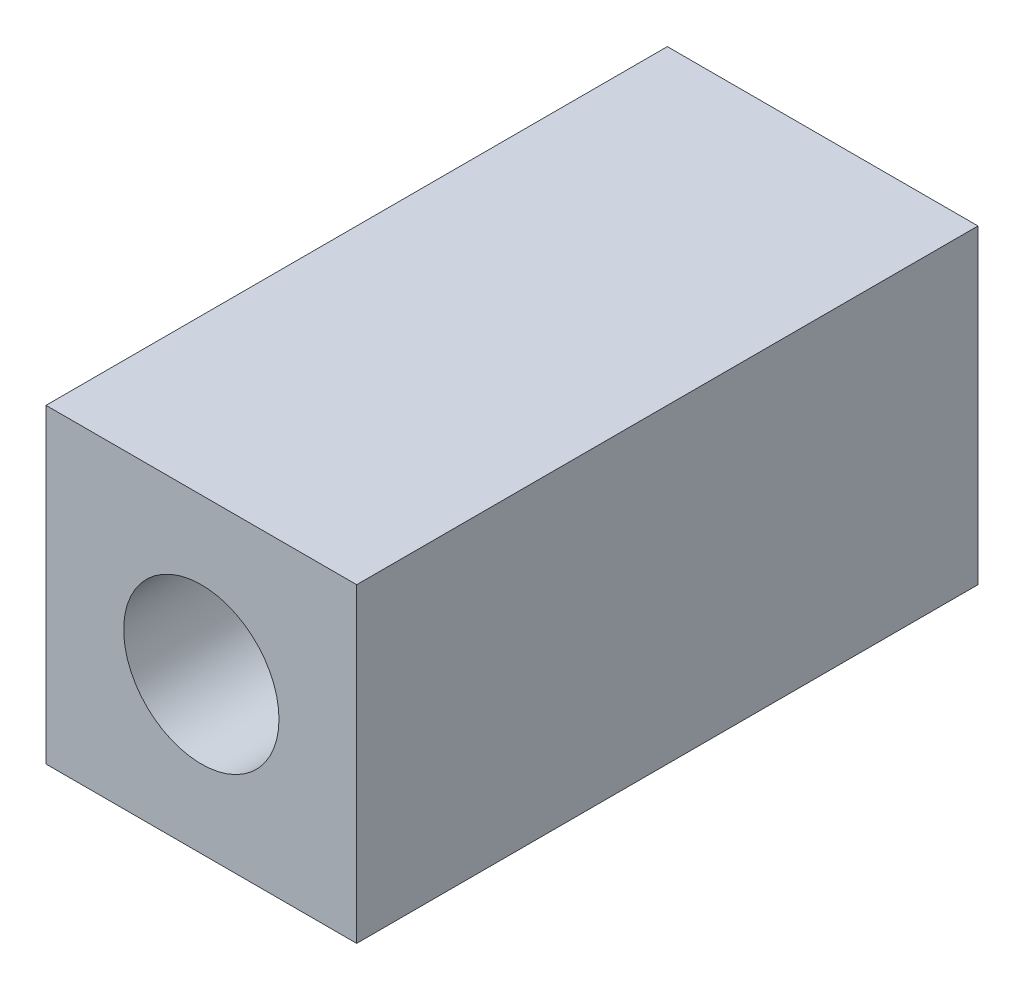
ISO-10303-21;
HEADER;
FILE_DESCRIPTION(('STEP AP214'),'2;1');
FILE_NAME('part.step','',(''),(''),'','','');
FILE_SCHEMA(('AUTOMOTIVE_DESIGN { 1 0 10303 214 1 1 1 1 }'));
ENDSEC;
DATA;
#1=APPLICATION_CONTEXT('core data for automotive mechanical design processes');
#2=APPLICATION_PROTOCOL_DEFINITION('international standard','automotive_design',2000,#1);
#3=PRODUCT_CONTEXT('',#1,'mechanical');
#4=PRODUCT('Part','Part','',(#3));
#5=PRODUCT_RELATED_PRODUCT_CATEGORY('part','',(#4));
#6=PRODUCT_DEFINITION_FORMATION('','',#4);
#7=PRODUCT_DEFINITION_CONTEXT('part definition',#1,'design');
#8=PRODUCT_DEFINITION('design','',#6,#7);
#9=PRODUCT_DEFINITION_SHAPE('','',#8);
#10=(LENGTH_UNIT() NAMED_UNIT(*) SI_UNIT(.MILLI.,.METRE.));
#11=(NAMED_UNIT(*) PLANE_ANGLE_UNIT() SI_UNIT($,.RADIAN.));
#12=(NAMED_UNIT(*) SI_UNIT($,.STERADIAN.) SOLID_ANGLE_UNIT());
#13=UNCERTAINTY_MEASURE_WITH_UNIT(LENGTH_MEASURE(1.E-05),#10,'distance_accuracy_value','');
#14=(GEOMETRIC_REPRESENTATION_CONTEXT(3) GLOBAL_UNCERTAINTY_ASSIGNED_CONTEXT((#13)) GLOBAL_UNIT_ASSIGNED_CONTEXT((#10,
#11,#12)) REPRESENTATION_CONTEXT('',''));
#15=CARTESIAN_POINT('',(0.,0.,0.));
#16=DIRECTION('',(0.,0.,1.));
#17=DIRECTION('',(1.,0.,0.));
#18=AXIS2_PLACEMENT_3D('',#15,#16,#17);
#19=CARTESIAN_POINT('',(0.,0.,20.));
#20=DIRECTION('',(0.,0.,1.));
#21=DIRECTION('',(1.,0.,0.));
#22=AXIS2_PLACEMENT_3D('',#19,#20,#21);
#23=PLANE('',#22);
#24=DIRECTION('',(0.,-1.,0.));
#25=VECTOR('',#24,1.);
#26=CARTESIAN_POINT('',(0.,0.,20.));
#27=LINE('',#26,#25);
#28=CARTESIAN_POINT('',(0.,0.,20.));
#29=VERTEX_POINT('',#28);
#30=CARTESIAN_POINT('',(0.,-10.,20.));
#31=VERTEX_POINT('',#30);
#32=EDGE_CURVE('E85',#29,#31,#27,.T.);
#33=ORIENTED_EDGE('',*,*,#32,.T.);
#34=DIRECTION('',(1.,0.,0.));
#35=VECTOR('',#34,1.);
#36=CARTESIAN_POINT('',(0.,-10.,20.));
#37=LINE('',#36,#35);
#38=CARTESIAN_POINT('',(10.,-10.,20.));
#39=VERTEX_POINT('',#38);
#40=EDGE_CURVE('E80',#31,#39,#37,.T.);
#41=ORIENTED_EDGE('',*,*,#40,.T.);
#42=DIRECTION('',(0.,1.,0.));
#43=VECTOR('',#42,1.);
#44=CARTESIAN_POINT('',(10.,0.,20.));
#45=LINE('',#44,#43);
#46=CARTESIAN_POINT('',(10.,0.,20.));
#47=VERTEX_POINT('',#46);
#48=EDGE_CURVE('E83',#39,#47,#45,.T.);
#49=ORIENTED_EDGE('',*,*,#48,.T.);
#50=DIRECTION('',(-1.,0.,0.));
#51=VECTOR('',#50,1.);
#52=CARTESIAN_POINT('',(0.,0.,20.));
#53=LINE('',#52,#51);
#54=EDGE_CURVE('E50',#47,#29,#53,.T.);
#55=ORIENTED_EDGE('',*,*,#54,.T.);
#56=EDGE_LOOP('',(#33,#41,#49,#55));
#57=FACE_BOUND('',#56,.T.);
#58=CARTESIAN_POINT('',(5.,-5.,20.));
#59=DIRECTION('',(0.,0.,1.));
#60=DIRECTION('',(1.,0.,0.));
#61=AXIS2_PLACEMENT_3D('',#58,#59,#60);
#62=CIRCLE('',#61,2.5);
#63=CARTESIAN_POINT('',(7.5,-5.,20.));
#64=VERTEX_POINT('',#63);
#65=EDGE_CURVE('E100',#64,#64,#62,.T.);
#66=ORIENTED_EDGE('',*,*,#65,.F.);
#67=EDGE_LOOP('',(#66));
#68=FACE_BOUND('',#67,.T.);
#69=ADVANCED_FACE('F33',(#57,#68),#23,.T.);
#70=CARTESIAN_POINT('',(0.,0.,0.));
#71=DIRECTION('',(0.,0.,1.));
#72=DIRECTION('',(1.,0.,0.));
#73=AXIS2_PLACEMENT_3D('',#70,#71,#72);
#74=PLANE('',#73);
#75=DIRECTION('',(0.,-1.,0.));
#76=VECTOR('',#75,1.);
#77=CARTESIAN_POINT('',(0.,0.,0.));
#78=LINE('',#77,#76);
#79=CARTESIAN_POINT('',(0.,0.,0.));
#80=VERTEX_POINT('',#79);
#81=CARTESIAN_POINT('',(0.,-10.,0.));
#82=VERTEX_POINT('',#81);
#83=EDGE_CURVE('E97',#80,#82,#78,.T.);
#84=ORIENTED_EDGE('',*,*,#83,.F.);
#85=DIRECTION('',(-1.,0.,0.));
#86=VECTOR('',#85,1.);
#87=CARTESIAN_POINT('',(0.,0.,0.));
#88=LINE('',#87,#86);
#89=CARTESIAN_POINT('',(10.,0.,0.));
#90=VERTEX_POINT('',#89);
#91=EDGE_CURVE('E73',#90,#80,#88,.T.);
#92=ORIENTED_EDGE('',*,*,#91,.F.);
#93=DIRECTION('',(0.,1.,0.));
#94=VECTOR('',#93,1.);
#95=CARTESIAN_POINT('',(10.,0.,0.));
#96=LINE('',#95,#94);
#97=CARTESIAN_POINT('',(10.,-10.,0.));
#98=VERTEX_POINT('',#97);
#99=EDGE_CURVE('E67',#98,#90,#96,.T.);
#100=ORIENTED_EDGE('',*,*,#99,.F.);
#101=DIRECTION('',(1.,0.,0.));
#102=VECTOR('',#101,1.);
#103=CARTESIAN_POINT('',(0.,-10.,0.));
#104=LINE('',#103,#102);
#105=EDGE_CURVE('E89',#82,#98,#104,.T.);
#106=ORIENTED_EDGE('',*,*,#105,.F.);
#107=EDGE_LOOP('',(#84,#92,#100,#106));
#108=FACE_BOUND('',#107,.T.);
#109=CARTESIAN_POINT('',(5.,-5.,0.));
#110=DIRECTION('',(0.,0.,1.));
#111=DIRECTION('',(1.,0.,0.));
#112=AXIS2_PLACEMENT_3D('',#109,#110,#111);
#113=CIRCLE('',#112,2.5);
#114=CARTESIAN_POINT('',(7.5,-5.,0.));
#115=VERTEX_POINT('',#114);
#116=EDGE_CURVE('E112',#115,#115,#113,.T.);
#117=ORIENTED_EDGE('',*,*,#116,.T.);
#118=EDGE_LOOP('',(#117));
#119=FACE_BOUND('',#118,.T.);
#120=ADVANCED_FACE('F108',(#108,#119),#74,.F.);
#121=CARTESIAN_POINT('',(0.,0.,20.));
#122=DIRECTION('',(1.,0.,0.));
#123=DIRECTION('',(0.,0.,-1.));
#124=AXIS2_PLACEMENT_3D('',#121,#122,#123);
#125=PLANE('',#124);
#126=ORIENTED_EDGE('',*,*,#83,.T.);
#127=DIRECTION('',(0.,0.,-1.));
#128=VECTOR('',#127,1.);
#129=CARTESIAN_POINT('',(0.,-10.,20.));
#130=LINE('',#129,#128);
#131=EDGE_CURVE('E11',#31,#82,#130,.T.);
#132=ORIENTED_EDGE('',*,*,#131,.F.);
#133=ORIENTED_EDGE('',*,*,#32,.F.);
#134=DIRECTION('',(0.,0.,-1.));
#135=VECTOR('',#134,1.);
#136=CARTESIAN_POINT('',(0.,0.,20.));
#137=LINE('',#136,#135);
#138=EDGE_CURVE('E93',#29,#80,#137,.T.);
#139=ORIENTED_EDGE('',*,*,#138,.T.);
#140=EDGE_LOOP('',(#126,#132,#133,#139));
#141=FACE_BOUND('',#140,.T.);
#142=ADVANCED_FACE('F35',(#141),#125,.F.);
#143=CARTESIAN_POINT('',(0.,-10.,20.));
#144=DIRECTION('',(0.,1.,0.));
#145=DIRECTION('',(-1.,0.,0.));
#146=AXIS2_PLACEMENT_3D('',#143,#144,#145);
#147=PLANE('',#146);
#148=ORIENTED_EDGE('',*,*,#105,.T.);
#149=DIRECTION('',(0.,0.,-1.));
#150=VECTOR('',#149,1.);
#151=CARTESIAN_POINT('',(10.,-10.,20.));
#152=LINE('',#151,#150);
#153=EDGE_CURVE('E42',#39,#98,#152,.T.);
#154=ORIENTED_EDGE('',*,*,#153,.F.);
#155=ORIENTED_EDGE('',*,*,#40,.F.);
#156=ORIENTED_EDGE('',*,*,#131,.T.);
#157=EDGE_LOOP('',(#148,#154,#155,#156));
#158=FACE_BOUND('',#157,.T.);
#159=ADVANCED_FACE('F88',(#158),#147,.F.);
#160=CARTESIAN_POINT('',(10.,0.,20.));
#161=DIRECTION('',(-1.,0.,0.));
#162=DIRECTION('',(0.,-1.,0.));
#163=AXIS2_PLACEMENT_3D('',#160,#161,#162);
#164=PLANE('',#163);
#165=ORIENTED_EDGE('',*,*,#99,.T.);
#166=DIRECTION('',(0.,0.,-1.));
#167=VECTOR('',#166,1.);
#168=CARTESIAN_POINT('',(10.,0.,20.));
#169=LINE('',#168,#167);
#170=EDGE_CURVE('E90',#47,#90,#169,.T.);
#171=ORIENTED_EDGE('',*,*,#170,.F.);
#172=ORIENTED_EDGE('',*,*,#48,.F.);
#173=ORIENTED_EDGE('',*,*,#153,.T.);
#174=EDGE_LOOP('',(#165,#171,#172,#173));
#175=FACE_BOUND('',#174,.T.);
#176=ADVANCED_FACE('F91',(#175),#164,.F.);
#177=CARTESIAN_POINT('',(0.,0.,20.));
#178=DIRECTION('',(0.,-1.,0.));
#179=DIRECTION('',(1.,0.,0.));
#180=AXIS2_PLACEMENT_3D('',#177,#178,#179);
#181=PLANE('',#180);
#182=ORIENTED_EDGE('',*,*,#91,.T.);
#183=ORIENTED_EDGE('',*,*,#138,.F.);
#184=ORIENTED_EDGE('',*,*,#54,.F.);
#185=ORIENTED_EDGE('',*,*,#170,.T.);
#186=EDGE_LOOP('',(#182,#183,#184,#185));
#187=FACE_BOUND('',#186,.T.);
#188=ADVANCED_FACE('F105',(#187),#181,.F.);
#189=CARTESIAN_POINT('',(5.,-5.,20.));
#190=DIRECTION('',(0.,0.,-1.));
#191=DIRECTION('',(-1.,0.,0.));
#192=AXIS2_PLACEMENT_3D('',#189,#190,#191);
#193=CYLINDRICAL_SURFACE('',#192,2.5);
#194=ORIENTED_EDGE('',*,*,#65,.T.);
#195=EDGE_LOOP('',(#194));
#196=FACE_BOUND('',#195,.T.);
#197=ORIENTED_EDGE('',*,*,#116,.F.);
#198=EDGE_LOOP('',(#197));
#199=FACE_BOUND('',#198,.T.);
#200=ADVANCED_FACE('F118',(#196,#199),#193,.F.);
#201=CLOSED_SHELL('',(#69,#120,#142,#159,#176,#188,#200));
#202=MANIFOLD_SOLID_BREP('B2',#201);
#203=ADVANCED_BREP_SHAPE_REPRESENTATION('',(#18,#202),#14);
#204=SHAPE_DEFINITION_REPRESENTATION(#9,#203);
ENDSEC;
END-ISO-10303-21;
